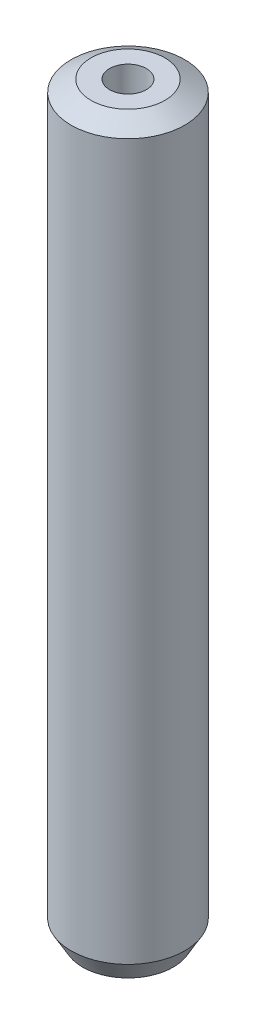
ISO-10303-21;
HEADER;
FILE_DESCRIPTION(('STEP AP214'),'2;1');
FILE_NAME('part.step','',(''),(''),'','','');
FILE_SCHEMA(('AUTOMOTIVE_DESIGN { 1 0 10303 214 1 1 1 1 }'));
ENDSEC;
DATA;
#1=APPLICATION_CONTEXT('core data for automotive mechanical design processes');
#2=APPLICATION_PROTOCOL_DEFINITION('international standard','automotive_design',2000,#1);
#3=PRODUCT_CONTEXT('',#1,'mechanical');
#4=PRODUCT('Part','Part','',(#3));
#5=PRODUCT_RELATED_PRODUCT_CATEGORY('part','',(#4));
#6=PRODUCT_DEFINITION_FORMATION('','',#4);
#7=PRODUCT_DEFINITION_CONTEXT('part definition',#1,'design');
#8=PRODUCT_DEFINITION('design','',#6,#7);
#9=PRODUCT_DEFINITION_SHAPE('','',#8);
#10=(LENGTH_UNIT() NAMED_UNIT(*) SI_UNIT(.MILLI.,.METRE.));
#11=(NAMED_UNIT(*) PLANE_ANGLE_UNIT() SI_UNIT($,.RADIAN.));
#12=(NAMED_UNIT(*) SI_UNIT($,.STERADIAN.) SOLID_ANGLE_UNIT());
#13=UNCERTAINTY_MEASURE_WITH_UNIT(LENGTH_MEASURE(1.E-05),#10,'distance_accuracy_value','');
#14=(GEOMETRIC_REPRESENTATION_CONTEXT(3) GLOBAL_UNCERTAINTY_ASSIGNED_CONTEXT((#13)) GLOBAL_UNIT_ASSIGNED_CONTEXT((#10,
#11,#12)) REPRESENTATION_CONTEXT('',''));
#15=CARTESIAN_POINT('',(0.,0.,0.));
#16=DIRECTION('',(0.,0.,1.));
#17=DIRECTION('',(1.,0.,0.));
#18=AXIS2_PLACEMENT_3D('',#15,#16,#17);
#19=CARTESIAN_POINT('',(0.,262.723898033504,0.));
#20=DIRECTION('',(0.,-1.,0.));
#21=DIRECTION('',(0.,0.,-1.));
#22=AXIS2_PLACEMENT_3D('',#19,#20,#21);
#23=CYLINDRICAL_SURFACE('',#22,20.);
#24=CARTESIAN_POINT('',(0.,258.676920211114,0.));
#25=DIRECTION('',(0.,1.,0.));
#26=DIRECTION('',(0.,0.,1.));
#27=AXIS2_PLACEMENT_3D('',#24,#25,#26);
#28=CIRCLE('',#27,20.);
#29=CARTESIAN_POINT('',(0.,258.676920211114,20.));
#30=VERTEX_POINT('',#29);
#31=EDGE_CURVE('E50',#30,#30,#28,.F.);
#32=ORIENTED_EDGE('',*,*,#31,.T.);
#33=EDGE_LOOP('',(#32));
#34=FACE_BOUND('',#33,.T.);
#35=CARTESIAN_POINT('',(0.,7.00957120548362,0.));
#36=DIRECTION('',(0.,1.,0.));
#37=DIRECTION('',(0.,0.,1.));
#38=AXIS2_PLACEMENT_3D('',#35,#36,#37);
#39=CIRCLE('',#38,20.);
#40=CARTESIAN_POINT('',(0.,7.00957120548362,20.));
#41=VERTEX_POINT('',#40);
#42=EDGE_CURVE('E51',#41,#41,#39,.T.);
#43=ORIENTED_EDGE('',*,*,#42,.T.);
#44=EDGE_LOOP('',(#43));
#45=FACE_BOUND('',#44,.T.);
#46=ADVANCED_FACE('F39',(#34,#45),#23,.T.);
#47=CARTESIAN_POINT('',(0.,262.723898033504,0.));
#48=DIRECTION('',(0.,1.,0.));
#49=DIRECTION('',(0.,0.,1.));
#50=AXIS2_PLACEMENT_3D('',#47,#48,#49);
#51=PLANE('',#50);
#52=CARTESIAN_POINT('',(0.,262.723898033504,0.));
#53=DIRECTION('',(0.,1.,0.));
#54=DIRECTION('',(0.,0.,1.));
#55=AXIS2_PLACEMENT_3D('',#52,#53,#54);
#56=CIRCLE('',#55,12.9904287945163);
#57=CARTESIAN_POINT('',(0.,262.723898033504,12.9904287945163));
#58=VERTEX_POINT('',#57);
#59=EDGE_CURVE('E54',#58,#58,#56,.T.);
#60=ORIENTED_EDGE('',*,*,#59,.T.);
#61=EDGE_LOOP('',(#60));
#62=FACE_BOUND('',#61,.T.);
#63=CARTESIAN_POINT('',(0.,262.723898033504,0.));
#64=DIRECTION('',(0.,1.,0.));
#65=DIRECTION('',(0.,0.,1.));
#66=AXIS2_PLACEMENT_3D('',#63,#64,#65);
#67=CIRCLE('',#66,6.46653873580415);
#68=CARTESIAN_POINT('',(0.,262.723898033504,6.46653873580415));
#69=VERTEX_POINT('',#68);
#70=EDGE_CURVE('E58',#69,#69,#67,.T.);
#71=ORIENTED_EDGE('',*,*,#70,.F.);
#72=EDGE_LOOP('',(#71));
#73=FACE_BOUND('',#72,.T.);
#74=ADVANCED_FACE('F69',(#62,#73),#51,.T.);
#75=CARTESIAN_POINT('',(0.,0.,0.));
#76=DIRECTION('',(0.,1.,0.));
#77=DIRECTION('',(0.,0.,1.));
#78=AXIS2_PLACEMENT_3D('',#75,#76,#77);
#79=PLANE('',#78);
#80=CARTESIAN_POINT('',(0.,0.,0.));
#81=DIRECTION('',(0.,1.,0.));
#82=DIRECTION('',(0.,0.,1.));
#83=AXIS2_PLACEMENT_3D('',#80,#81,#82);
#84=CIRCLE('',#83,15.9530221776101);
#85=CARTESIAN_POINT('',(0.,0.,15.9530221776101));
#86=VERTEX_POINT('',#85);
#87=EDGE_CURVE('E10',#86,#86,#84,.F.);
#88=ORIENTED_EDGE('',*,*,#87,.T.);
#89=EDGE_LOOP('',(#88));
#90=FACE_BOUND('',#89,.T.);
#91=CARTESIAN_POINT('',(0.,0.,0.));
#92=DIRECTION('',(0.,1.,0.));
#93=DIRECTION('',(0.,0.,1.));
#94=AXIS2_PLACEMENT_3D('',#91,#92,#93);
#95=CIRCLE('',#94,6.46653873580415);
#96=CARTESIAN_POINT('',(0.,0.,6.46653873580415));
#97=VERTEX_POINT('',#96);
#98=EDGE_CURVE('E63',#97,#97,#95,.T.);
#99=ORIENTED_EDGE('',*,*,#98,.T.);
#100=EDGE_LOOP('',(#99));
#101=FACE_BOUND('',#100,.T.);
#102=ADVANCED_FACE('F75',(#90,#101),#79,.F.);
#103=CARTESIAN_POINT('',(0.,262.723898033504,0.));
#104=DIRECTION('',(0.,-1.,0.));
#105=DIRECTION('',(0.,0.,-1.));
#106=AXIS2_PLACEMENT_3D('',#103,#104,#105);
#107=CYLINDRICAL_SURFACE('',#106,6.46653873580415);
#108=ORIENTED_EDGE('',*,*,#70,.T.);
#109=EDGE_LOOP('',(#108));
#110=FACE_BOUND('',#109,.T.);
#111=ORIENTED_EDGE('',*,*,#98,.F.);
#112=EDGE_LOOP('',(#111));
#113=FACE_BOUND('',#112,.T.);
#114=ADVANCED_FACE('F70',(#110,#113),#107,.F.);
#115=CARTESIAN_POINT('',(0.,262.723898033504,0.));
#116=DIRECTION('',(0.,-1.,0.));
#117=DIRECTION('',(0.,0.,-1.));
#118=AXIS2_PLACEMENT_3D('',#115,#116,#117);
#119=CONICAL_SURFACE('',#118,12.9904287945163,1.04719755119659);
#120=ORIENTED_EDGE('',*,*,#31,.F.);
#121=EDGE_LOOP('',(#120));
#122=FACE_BOUND('',#121,.T.);
#123=ORIENTED_EDGE('',*,*,#59,.F.);
#124=EDGE_LOOP('',(#123));
#125=FACE_BOUND('',#124,.T.);
#126=ADVANCED_FACE('F81',(#122,#125),#119,.T.);
#127=CARTESIAN_POINT('',(0.,7.00957120548362,0.));
#128=DIRECTION('',(0.,1.,0.));
#129=DIRECTION('',(0.,0.,1.));
#130=AXIS2_PLACEMENT_3D('',#127,#128,#129);
#131=CONICAL_SURFACE('',#130,20.,0.523598775598303);
#132=ORIENTED_EDGE('',*,*,#87,.F.);
#133=EDGE_LOOP('',(#132));
#134=FACE_BOUND('',#133,.T.);
#135=ORIENTED_EDGE('',*,*,#42,.F.);
#136=EDGE_LOOP('',(#135));
#137=FACE_BOUND('',#136,.T.);
#138=ADVANCED_FACE('F45',(#134,#137),#131,.T.);
#139=CLOSED_SHELL('',(#46,#74,#102,#114,#126,#138));
#140=MANIFOLD_SOLID_BREP('B2',#139);
#141=ADVANCED_BREP_SHAPE_REPRESENTATION('',(#18,#140),#14);
#142=SHAPE_DEFINITION_REPRESENTATION(#9,#141);
ENDSEC;
END-ISO-10303-21;
